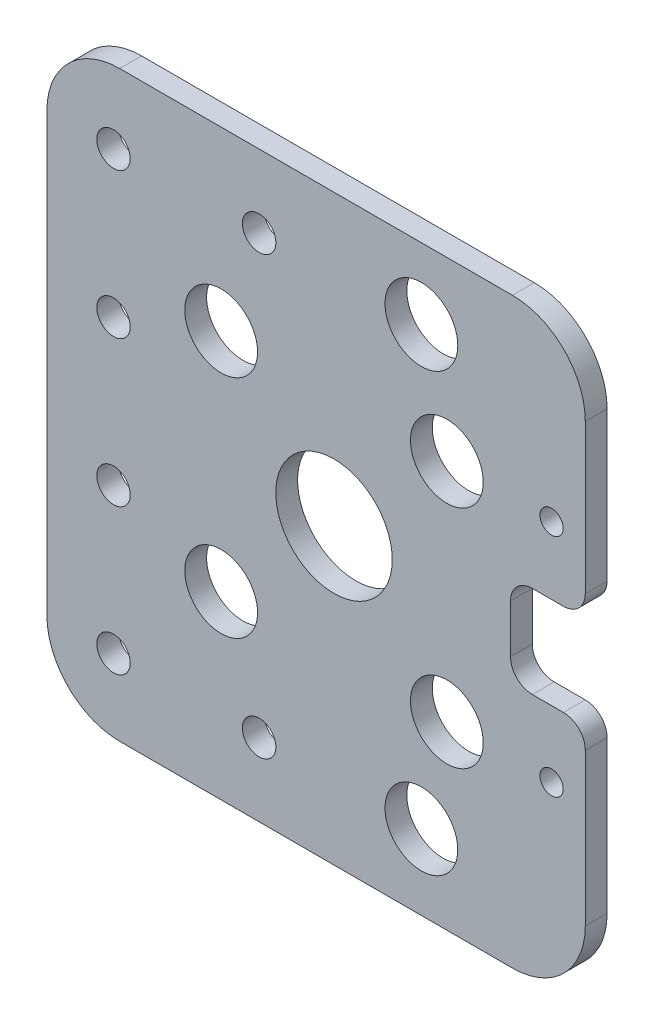
ISO-10303-21;
HEADER;
FILE_DESCRIPTION(('STEP AP214'),'2;1');
FILE_NAME('part.step','',(''),(''),'','','');
FILE_SCHEMA(('AUTOMOTIVE_DESIGN { 1 0 10303 214 1 1 1 1 }'));
ENDSEC;
DATA;
#1=APPLICATION_CONTEXT('core data for automotive mechanical design processes');
#2=APPLICATION_PROTOCOL_DEFINITION('international standard','automotive_design',2000,#1);
#3=PRODUCT_CONTEXT('',#1,'mechanical');
#4=PRODUCT('Part','Part','',(#3));
#5=PRODUCT_RELATED_PRODUCT_CATEGORY('part','',(#4));
#6=PRODUCT_DEFINITION_FORMATION('','',#4);
#7=PRODUCT_DEFINITION_CONTEXT('part definition',#1,'design');
#8=PRODUCT_DEFINITION('design','',#6,#7);
#9=PRODUCT_DEFINITION_SHAPE('','',#8);
#10=(LENGTH_UNIT() NAMED_UNIT(*) SI_UNIT(.MILLI.,.METRE.));
#11=(NAMED_UNIT(*) PLANE_ANGLE_UNIT() SI_UNIT($,.RADIAN.));
#12=(NAMED_UNIT(*) SI_UNIT($,.STERADIAN.) SOLID_ANGLE_UNIT());
#13=UNCERTAINTY_MEASURE_WITH_UNIT(LENGTH_MEASURE(1.E-05),#10,'distance_accuracy_value','');
#14=(GEOMETRIC_REPRESENTATION_CONTEXT(3) GLOBAL_UNCERTAINTY_ASSIGNED_CONTEXT((#13)) GLOBAL_UNIT_ASSIGNED_CONTEXT((#10,
#11,#12)) REPRESENTATION_CONTEXT('',''));
#15=CARTESIAN_POINT('',(0.,0.,0.));
#16=DIRECTION('',(0.,0.,1.));
#17=DIRECTION('',(1.,0.,0.));
#18=AXIS2_PLACEMENT_3D('',#15,#16,#17);
#19=CARTESIAN_POINT('',(170.473892307227,-141.896756478859,3.));
#20=DIRECTION('',(0.,0.,-1.));
#21=DIRECTION('',(-1.,0.,0.));
#22=AXIS2_PLACEMENT_3D('',#19,#20,#21);
#23=PLANE('',#22);
#24=DIRECTION('',(0.,1.,0.));
#25=VECTOR('',#24,1.);
#26=CARTESIAN_POINT('',(180.473892307227,-120.989469863567,3.));
#27=LINE('',#26,#25);
#28=CARTESIAN_POINT('',(180.473892307227,-141.896756478859,3.));
#29=VERTEX_POINT('',#28);
#30=CARTESIAN_POINT('',(180.473892307227,-120.989469863567,3.));
#31=VERTEX_POINT('',#30);
#32=EDGE_CURVE('E147',#29,#31,#27,.T.);
#33=ORIENTED_EDGE('',*,*,#32,.T.);
#34=CARTESIAN_POINT('',(177.473892307227,-120.989469863567,3.));
#35=DIRECTION('',(0.,0.,-1.));
#36=DIRECTION('',(-1.,0.,0.));
#37=AXIS2_PLACEMENT_3D('',#34,#35,#36);
#38=CIRCLE('',#37,3.);
#39=CARTESIAN_POINT('',(177.473892307227,-117.989469863567,3.));
#40=VERTEX_POINT('',#39);
#41=EDGE_CURVE('E195',#31,#40,#38,.F.);
#42=ORIENTED_EDGE('',*,*,#41,.T.);
#43=DIRECTION('',(-1.,0.,0.));
#44=VECTOR('',#43,1.);
#45=CARTESIAN_POINT('',(180.473892307227,-117.989469863567,3.));
#46=LINE('',#45,#44);
#47=CARTESIAN_POINT('',(173.198907284921,-117.989469863567,3.));
#48=VERTEX_POINT('',#47);
#49=EDGE_CURVE('E157',#40,#48,#46,.T.);
#50=ORIENTED_EDGE('',*,*,#49,.T.);
#51=CARTESIAN_POINT('',(173.198907284921,-114.989469863567,3.));
#52=DIRECTION('',(0.,0.,-1.));
#53=DIRECTION('',(-1.,0.,0.));
#54=AXIS2_PLACEMENT_3D('',#51,#52,#53);
#55=CIRCLE('',#54,3.);
#56=CARTESIAN_POINT('',(170.198907284921,-114.989469863567,3.));
#57=VERTEX_POINT('',#56);
#58=EDGE_CURVE('E206',#48,#57,#55,.T.);
#59=ORIENTED_EDGE('',*,*,#58,.T.);
#60=DIRECTION('',(0.,1.,0.));
#61=VECTOR('',#60,1.);
#62=CARTESIAN_POINT('',(170.198907284921,-105.365535019324,3.));
#63=LINE('',#62,#61);
#64=CARTESIAN_POINT('',(170.198907284921,-108.365535019324,3.));
#65=VERTEX_POINT('',#64);
#66=EDGE_CURVE('E229',#57,#65,#63,.T.);
#67=ORIENTED_EDGE('',*,*,#66,.T.);
#68=CARTESIAN_POINT('',(173.198907284921,-108.365535019324,3.));
#69=DIRECTION('',(0.,0.,-1.));
#70=DIRECTION('',(-1.,0.,0.));
#71=AXIS2_PLACEMENT_3D('',#68,#69,#70);
#72=CIRCLE('',#71,3.);
#73=CARTESIAN_POINT('',(173.198907284921,-105.365535019324,3.));
#74=VERTEX_POINT('',#73);
#75=EDGE_CURVE('E11',#65,#74,#72,.T.);
#76=ORIENTED_EDGE('',*,*,#75,.T.);
#77=DIRECTION('',(1.,0.,0.));
#78=VECTOR('',#77,1.);
#79=CARTESIAN_POINT('',(180.473892307227,-105.365535019324,3.));
#80=LINE('',#79,#78);
#81=CARTESIAN_POINT('',(177.473892307227,-105.365535019324,3.));
#82=VERTEX_POINT('',#81);
#83=EDGE_CURVE('E228',#74,#82,#80,.T.);
#84=ORIENTED_EDGE('',*,*,#83,.T.);
#85=CARTESIAN_POINT('',(177.473892307227,-102.365535019324,3.));
#86=DIRECTION('',(0.,0.,-1.));
#87=DIRECTION('',(-1.,0.,0.));
#88=AXIS2_PLACEMENT_3D('',#85,#86,#87);
#89=CIRCLE('',#88,3.);
#90=CARTESIAN_POINT('',(180.473892307227,-102.365535019324,3.));
#91=VERTEX_POINT('',#90);
#92=EDGE_CURVE('E48',#82,#91,#89,.F.);
#93=ORIENTED_EDGE('',*,*,#92,.T.);
#94=DIRECTION('',(0.,1.,0.));
#95=VECTOR('',#94,1.);
#96=CARTESIAN_POINT('',(180.473892307227,-102.365535019324,3.));
#97=LINE('',#96,#95);
#98=CARTESIAN_POINT('',(180.473892307227,-81.8661960079858,3.));
#99=VERTEX_POINT('',#98);
#100=EDGE_CURVE('E231',#91,#99,#97,.T.);
#101=ORIENTED_EDGE('',*,*,#100,.T.);
#102=CARTESIAN_POINT('',(170.473892307227,-81.8661960079857,3.));
#103=DIRECTION('',(0.,0.,1.));
#104=DIRECTION('',(1.,0.,0.));
#105=AXIS2_PLACEMENT_3D('',#102,#103,#104);
#106=CIRCLE('',#105,10.);
#107=CARTESIAN_POINT('',(170.473892307226,-71.8661960079857,3.));
#108=VERTEX_POINT('',#107);
#109=EDGE_CURVE('E233',#99,#108,#106,.T.);
#110=ORIENTED_EDGE('',*,*,#109,.T.);
#111=DIRECTION('',(-1.,0.,0.));
#112=VECTOR('',#111,1.);
#113=CARTESIAN_POINT('',(157.960700719284,-71.8661960079857,3.));
#114=LINE('',#113,#112);
#115=CARTESIAN_POINT('',(116.52582366594,-71.8661960079857,3.));
#116=VERTEX_POINT('',#115);
#117=EDGE_CURVE('E239',#108,#116,#114,.T.);
#118=ORIENTED_EDGE('',*,*,#117,.T.);
#119=CARTESIAN_POINT('',(116.52582366594,-81.8661960079857,3.));
#120=DIRECTION('',(0.,0.,1.));
#121=DIRECTION('',(1.,0.,0.));
#122=AXIS2_PLACEMENT_3D('',#119,#120,#121);
#123=CIRCLE('',#122,9.99999999999999);
#124=CARTESIAN_POINT('',(106.52582366594,-81.8661960079857,3.));
#125=VERTEX_POINT('',#124);
#126=EDGE_CURVE('E241',#116,#125,#123,.T.);
#127=ORIENTED_EDGE('',*,*,#126,.T.);
#128=DIRECTION('',(0.,-1.,0.));
#129=VECTOR('',#128,1.);
#130=CARTESIAN_POINT('',(106.52582366594,-81.8661960079857,3.));
#131=LINE('',#130,#129);
#132=CARTESIAN_POINT('',(106.52582366594,-141.896756478859,3.));
#133=VERTEX_POINT('',#132);
#134=EDGE_CURVE('E243',#125,#133,#131,.T.);
#135=ORIENTED_EDGE('',*,*,#134,.T.);
#136=CARTESIAN_POINT('',(116.52582366594,-141.896756478859,3.));
#137=DIRECTION('',(0.,0.,1.));
#138=DIRECTION('',(1.,0.,0.));
#139=AXIS2_PLACEMENT_3D('',#136,#137,#138);
#140=CIRCLE('',#139,9.99999999999999);
#141=CARTESIAN_POINT('',(116.52582366594,-151.896756478859,3.));
#142=VERTEX_POINT('',#141);
#143=EDGE_CURVE('E245',#133,#142,#140,.T.);
#144=ORIENTED_EDGE('',*,*,#143,.T.);
#145=DIRECTION('',(1.,0.,0.));
#146=VECTOR('',#145,1.);
#147=CARTESIAN_POINT('',(116.52582366594,-151.896756478859,3.));
#148=LINE('',#147,#146);
#149=CARTESIAN_POINT('',(170.473892307226,-151.896756478859,3.));
#150=VERTEX_POINT('',#149);
#151=EDGE_CURVE('E163',#142,#150,#148,.T.);
#152=ORIENTED_EDGE('',*,*,#151,.T.);
#153=CARTESIAN_POINT('',(170.473892307227,-141.896756478859,3.));
#154=DIRECTION('',(0.,0.,1.));
#155=DIRECTION('',(-1.,0.,0.));
#156=AXIS2_PLACEMENT_3D('',#153,#154,#155);
#157=CIRCLE('',#156,10.);
#158=EDGE_CURVE('E158',#150,#29,#157,.T.);
#159=ORIENTED_EDGE('',*,*,#158,.T.);
#160=EDGE_LOOP('',(#33,#42,#50,#59,#67,#76,#84,#93,#101,#110,#118,#127,#135,#144,#152,#159));
#161=FACE_BOUND('',#160,.T.);
#162=CARTESIAN_POINT('',(115.674612815836,-101.866196007986,3.));
#163=DIRECTION('',(0.,0.,1.));
#164=DIRECTION('',(1.,0.,0.));
#165=AXIS2_PLACEMENT_3D('',#162,#163,#164);
#166=CIRCLE('',#165,2.29999999999999);
#167=CARTESIAN_POINT('',(117.974612815836,-101.866196007986,3.));
#168=VERTEX_POINT('',#167);
#169=EDGE_CURVE('E251',#168,#168,#166,.T.);
#170=ORIENTED_EDGE('',*,*,#169,.F.);
#171=EDGE_LOOP('',(#170));
#172=FACE_BOUND('',#171,.T.);
#173=CARTESIAN_POINT('',(115.674612815836,-121.866196007986,3.));
#174=DIRECTION('',(0.,0.,1.));
#175=DIRECTION('',(1.,0.,0.));
#176=AXIS2_PLACEMENT_3D('',#173,#174,#175);
#177=CIRCLE('',#176,2.30000000000001);
#178=CARTESIAN_POINT('',(117.974612815836,-121.866196007986,3.));
#179=VERTEX_POINT('',#178);
#180=EDGE_CURVE('E376',#179,#179,#177,.T.);
#181=ORIENTED_EDGE('',*,*,#180,.F.);
#182=EDGE_LOOP('',(#181));
#183=FACE_BOUND('',#182,.T.);
#184=CARTESIAN_POINT('',(135.674612815836,-141.866196007986,3.));
#185=DIRECTION('',(0.,0.,1.));
#186=DIRECTION('',(1.,0.,0.));
#187=AXIS2_PLACEMENT_3D('',#184,#185,#186);
#188=CIRCLE('',#187,2.30000000000001);
#189=CARTESIAN_POINT('',(137.974612815836,-141.866196007986,3.));
#190=VERTEX_POINT('',#189);
#191=EDGE_CURVE('E382',#190,#190,#188,.T.);
#192=ORIENTED_EDGE('',*,*,#191,.F.);
#193=EDGE_LOOP('',(#192));
#194=FACE_BOUND('',#193,.T.);
#195=CARTESIAN_POINT('',(135.674612815836,-81.8661960079857,3.));
#196=DIRECTION('',(0.,0.,1.));
#197=DIRECTION('',(1.,0.,0.));
#198=AXIS2_PLACEMENT_3D('',#195,#196,#197);
#199=CIRCLE('',#198,2.30000000000001);
#200=CARTESIAN_POINT('',(137.974612815836,-81.8661960079857,3.));
#201=VERTEX_POINT('',#200);
#202=EDGE_CURVE('E388',#201,#201,#199,.T.);
#203=ORIENTED_EDGE('',*,*,#202,.F.);
#204=EDGE_LOOP('',(#203));
#205=FACE_BOUND('',#204,.T.);
#206=CARTESIAN_POINT('',(161.460700719284,-96.1142218306485,3.));
#207=DIRECTION('',(0.,0.,1.));
#208=DIRECTION('',(1.,0.,0.));
#209=AXIS2_PLACEMENT_3D('',#206,#207,#208);
#210=CIRCLE('',#209,4.99999999999999);
#211=CARTESIAN_POINT('',(166.460700719284,-96.1142218306485,3.));
#212=VERTEX_POINT('',#211);
#213=EDGE_CURVE('E394',#212,#212,#210,.T.);
#214=ORIENTED_EDGE('',*,*,#213,.F.);
#215=EDGE_LOOP('',(#214));
#216=FACE_BOUND('',#215,.T.);
#217=CARTESIAN_POINT('',(115.674612815836,-81.8661960079857,3.));
#218=DIRECTION('',(0.,0.,1.));
#219=DIRECTION('',(1.,0.,0.));
#220=AXIS2_PLACEMENT_3D('',#217,#218,#219);
#221=CIRCLE('',#220,2.29999999999999);
#222=CARTESIAN_POINT('',(117.974612815836,-81.8661960079857,3.));
#223=VERTEX_POINT('',#222);
#224=EDGE_CURVE('E400',#223,#223,#221,.T.);
#225=ORIENTED_EDGE('',*,*,#224,.F.);
#226=EDGE_LOOP('',(#225));
#227=FACE_BOUND('',#226,.T.);
#228=CARTESIAN_POINT('',(115.674612815836,-141.866196007986,3.));
#229=DIRECTION('',(0.,0.,1.));
#230=DIRECTION('',(1.,0.,0.));
#231=AXIS2_PLACEMENT_3D('',#228,#229,#230);
#232=CIRCLE('',#231,2.30000000000001);
#233=CARTESIAN_POINT('',(117.974612815836,-141.866196007986,3.));
#234=VERTEX_POINT('',#233);
#235=EDGE_CURVE('E406',#234,#234,#232,.T.);
#236=ORIENTED_EDGE('',*,*,#235,.F.);
#237=EDGE_LOOP('',(#236));
#238=FACE_BOUND('',#237,.T.);
#239=CARTESIAN_POINT('',(161.460700719284,-127.114221830649,3.));
#240=DIRECTION('',(0.,0.,1.));
#241=DIRECTION('',(1.,0.,0.));
#242=AXIS2_PLACEMENT_3D('',#239,#240,#241);
#243=CIRCLE('',#242,5.00000000000002);
#244=CARTESIAN_POINT('',(166.460700719284,-127.114221830649,3.));
#245=VERTEX_POINT('',#244);
#246=EDGE_CURVE('E412',#245,#245,#243,.T.);
#247=ORIENTED_EDGE('',*,*,#246,.F.);
#248=EDGE_LOOP('',(#247));
#249=FACE_BOUND('',#248,.T.);
#250=CARTESIAN_POINT('',(175.843347401342,-127.114221830649,3.));
#251=DIRECTION('',(0.,0.,1.));
#252=DIRECTION('',(1.,0.,0.));
#253=AXIS2_PLACEMENT_3D('',#250,#251,#252);
#254=CIRCLE('',#253,1.59999999999999);
#255=CARTESIAN_POINT('',(177.443347401342,-127.114221830649,3.));
#256=VERTEX_POINT('',#255);
#257=EDGE_CURVE('E418',#256,#256,#254,.T.);
#258=ORIENTED_EDGE('',*,*,#257,.F.);
#259=EDGE_LOOP('',(#258));
#260=FACE_BOUND('',#259,.T.);
#261=CARTESIAN_POINT('',(175.843347401342,-96.1142218306485,3.));
#262=DIRECTION('',(0.,0.,1.));
#263=DIRECTION('',(1.,0.,0.));
#264=AXIS2_PLACEMENT_3D('',#261,#262,#263);
#265=CIRCLE('',#264,1.59999999999999);
#266=CARTESIAN_POINT('',(177.443347401342,-96.1142218306485,3.));
#267=VERTEX_POINT('',#266);
#268=EDGE_CURVE('E424',#267,#267,#265,.T.);
#269=ORIENTED_EDGE('',*,*,#268,.F.);
#270=EDGE_LOOP('',(#269));
#271=FACE_BOUND('',#270,.T.);
#272=CARTESIAN_POINT('',(145.960700719284,-111.591712302338,3.));
#273=DIRECTION('',(0.,0.,1.));
#274=DIRECTION('',(1.,0.,0.));
#275=AXIS2_PLACEMENT_3D('',#272,#273,#274);
#276=CIRCLE('',#275,8.00000000000001);
#277=CARTESIAN_POINT('',(153.960700719284,-111.591712302338,3.));
#278=VERTEX_POINT('',#277);
#279=EDGE_CURVE('E430',#278,#278,#276,.T.);
#280=ORIENTED_EDGE('',*,*,#279,.F.);
#281=EDGE_LOOP('',(#280));
#282=FACE_BOUND('',#281,.T.);
#283=CARTESIAN_POINT('',(130.460700719283,-96.1142218306486,3.));
#284=DIRECTION('',(0.,0.,1.));
#285=DIRECTION('',(1.,0.,0.));
#286=AXIS2_PLACEMENT_3D('',#283,#284,#285);
#287=CIRCLE('',#286,5.00000000000002);
#288=CARTESIAN_POINT('',(135.460700719284,-96.1142218306486,3.));
#289=VERTEX_POINT('',#288);
#290=EDGE_CURVE('E436',#289,#289,#287,.T.);
#291=ORIENTED_EDGE('',*,*,#290,.F.);
#292=EDGE_LOOP('',(#291));
#293=FACE_BOUND('',#292,.T.);
#294=CARTESIAN_POINT('',(157.960700719284,-141.591712302338,3.));
#295=DIRECTION('',(0.,0.,1.));
#296=DIRECTION('',(1.,0.,0.));
#297=AXIS2_PLACEMENT_3D('',#294,#295,#296);
#298=CIRCLE('',#297,4.99999999999999);
#299=CARTESIAN_POINT('',(162.960700719284,-141.591712302338,3.));
#300=VERTEX_POINT('',#299);
#301=EDGE_CURVE('E442',#300,#300,#298,.T.);
#302=ORIENTED_EDGE('',*,*,#301,.F.);
#303=EDGE_LOOP('',(#302));
#304=FACE_BOUND('',#303,.T.);
#305=CARTESIAN_POINT('',(157.960700719284,-81.5917123023381,3.));
#306=DIRECTION('',(0.,0.,1.));
#307=DIRECTION('',(1.,0.,0.));
#308=AXIS2_PLACEMENT_3D('',#305,#306,#307);
#309=CIRCLE('',#308,5.00000000000002);
#310=CARTESIAN_POINT('',(162.960700719284,-81.5917123023381,3.));
#311=VERTEX_POINT('',#310);
#312=EDGE_CURVE('E448',#311,#311,#309,.T.);
#313=ORIENTED_EDGE('',*,*,#312,.F.);
#314=EDGE_LOOP('',(#313));
#315=FACE_BOUND('',#314,.T.);
#316=CARTESIAN_POINT('',(130.460700719283,-127.114221830649,3.));
#317=DIRECTION('',(0.,0.,1.));
#318=DIRECTION('',(1.,0.,0.));
#319=AXIS2_PLACEMENT_3D('',#316,#317,#318);
#320=CIRCLE('',#319,4.99999999999999);
#321=CARTESIAN_POINT('',(135.460700719284,-127.114221830649,3.));
#322=VERTEX_POINT('',#321);
#323=EDGE_CURVE('E454',#322,#322,#320,.T.);
#324=ORIENTED_EDGE('',*,*,#323,.F.);
#325=EDGE_LOOP('',(#324));
#326=FACE_BOUND('',#325,.T.);
#327=ADVANCED_FACE('F33',(#161,#172,#183,#194,#205,#216,#227,#238,#249,#260,#271,#282,#293,#304,
#315,#326),#23,.F.);
#328=CARTESIAN_POINT('',(170.473892307227,-141.896756478859,0.));
#329=DIRECTION('',(0.,0.,-1.));
#330=DIRECTION('',(-1.,0.,0.));
#331=AXIS2_PLACEMENT_3D('',#328,#329,#330);
#332=PLANE('',#331);
#333=CARTESIAN_POINT('',(157.960700719284,-81.5917123023381,0.));
#334=DIRECTION('',(0.,0.,1.));
#335=DIRECTION('',(1.,0.,0.));
#336=AXIS2_PLACEMENT_3D('',#333,#334,#335);
#337=CIRCLE('',#336,5.00000000000002);
#338=CARTESIAN_POINT('',(162.960700719284,-81.5917123023381,0.));
#339=VERTEX_POINT('',#338);
#340=EDGE_CURVE('E451',#339,#339,#337,.T.);
#341=ORIENTED_EDGE('',*,*,#340,.T.);
#342=EDGE_LOOP('',(#341));
#343=FACE_BOUND('',#342,.T.);
#344=CARTESIAN_POINT('',(130.460700719283,-96.1142218306486,0.));
#345=DIRECTION('',(0.,0.,1.));
#346=DIRECTION('',(1.,0.,0.));
#347=AXIS2_PLACEMENT_3D('',#344,#345,#346);
#348=CIRCLE('',#347,5.00000000000002);
#349=CARTESIAN_POINT('',(135.460700719284,-96.1142218306486,0.));
#350=VERTEX_POINT('',#349);
#351=EDGE_CURVE('E439',#350,#350,#348,.T.);
#352=ORIENTED_EDGE('',*,*,#351,.T.);
#353=EDGE_LOOP('',(#352));
#354=FACE_BOUND('',#353,.T.);
#355=CARTESIAN_POINT('',(175.843347401342,-96.1142218306485,0.));
#356=DIRECTION('',(0.,0.,1.));
#357=DIRECTION('',(1.,0.,0.));
#358=AXIS2_PLACEMENT_3D('',#355,#356,#357);
#359=CIRCLE('',#358,1.59999999999999);
#360=CARTESIAN_POINT('',(177.443347401342,-96.1142218306485,0.));
#361=VERTEX_POINT('',#360);
#362=EDGE_CURVE('E427',#361,#361,#359,.T.);
#363=ORIENTED_EDGE('',*,*,#362,.T.);
#364=EDGE_LOOP('',(#363));
#365=FACE_BOUND('',#364,.T.);
#366=CARTESIAN_POINT('',(161.460700719284,-127.114221830649,0.));
#367=DIRECTION('',(0.,0.,1.));
#368=DIRECTION('',(1.,0.,0.));
#369=AXIS2_PLACEMENT_3D('',#366,#367,#368);
#370=CIRCLE('',#369,5.00000000000002);
#371=CARTESIAN_POINT('',(166.460700719284,-127.114221830649,0.));
#372=VERTEX_POINT('',#371);
#373=EDGE_CURVE('E415',#372,#372,#370,.T.);
#374=ORIENTED_EDGE('',*,*,#373,.T.);
#375=EDGE_LOOP('',(#374));
#376=FACE_BOUND('',#375,.T.);
#377=CARTESIAN_POINT('',(115.674612815836,-81.8661960079857,0.));
#378=DIRECTION('',(0.,0.,1.));
#379=DIRECTION('',(1.,0.,0.));
#380=AXIS2_PLACEMENT_3D('',#377,#378,#379);
#381=CIRCLE('',#380,2.29999999999999);
#382=CARTESIAN_POINT('',(117.974612815836,-81.8661960079857,0.));
#383=VERTEX_POINT('',#382);
#384=EDGE_CURVE('E403',#383,#383,#381,.T.);
#385=ORIENTED_EDGE('',*,*,#384,.T.);
#386=EDGE_LOOP('',(#385));
#387=FACE_BOUND('',#386,.T.);
#388=CARTESIAN_POINT('',(135.674612815836,-81.8661960079857,0.));
#389=DIRECTION('',(0.,0.,1.));
#390=DIRECTION('',(1.,0.,0.));
#391=AXIS2_PLACEMENT_3D('',#388,#389,#390);
#392=CIRCLE('',#391,2.30000000000001);
#393=CARTESIAN_POINT('',(137.974612815836,-81.8661960079857,0.));
#394=VERTEX_POINT('',#393);
#395=EDGE_CURVE('E391',#394,#394,#392,.T.);
#396=ORIENTED_EDGE('',*,*,#395,.T.);
#397=EDGE_LOOP('',(#396));
#398=FACE_BOUND('',#397,.T.);
#399=CARTESIAN_POINT('',(115.674612815836,-121.866196007986,0.));
#400=DIRECTION('',(0.,0.,1.));
#401=DIRECTION('',(1.,0.,0.));
#402=AXIS2_PLACEMENT_3D('',#399,#400,#401);
#403=CIRCLE('',#402,2.30000000000001);
#404=CARTESIAN_POINT('',(117.974612815836,-121.866196007986,0.));
#405=VERTEX_POINT('',#404);
#406=EDGE_CURVE('E379',#405,#405,#403,.T.);
#407=ORIENTED_EDGE('',*,*,#406,.T.);
#408=EDGE_LOOP('',(#407));
#409=FACE_BOUND('',#408,.T.);
#410=DIRECTION('',(-1.,0.,0.));
#411=VECTOR('',#410,1.);
#412=CARTESIAN_POINT('',(180.473892307227,-117.989469863567,0.));
#413=LINE('',#412,#411);
#414=CARTESIAN_POINT('',(177.473892307227,-117.989469863567,0.));
#415=VERTEX_POINT('',#414);
#416=CARTESIAN_POINT('',(173.198907284921,-117.989469863567,0.));
#417=VERTEX_POINT('',#416);
#418=EDGE_CURVE('E224',#415,#417,#413,.T.);
#419=ORIENTED_EDGE('',*,*,#418,.F.);
#420=CARTESIAN_POINT('',(177.473892307227,-120.989469863567,0.));
#421=DIRECTION('',(0.,0.,-1.));
#422=DIRECTION('',(-1.,0.,0.));
#423=AXIS2_PLACEMENT_3D('',#420,#421,#422);
#424=CIRCLE('',#423,3.);
#425=CARTESIAN_POINT('',(180.473892307227,-120.989469863567,0.));
#426=VERTEX_POINT('',#425);
#427=EDGE_CURVE('E191',#415,#426,#424,.T.);
#428=ORIENTED_EDGE('',*,*,#427,.T.);
#429=DIRECTION('',(0.,1.,0.));
#430=VECTOR('',#429,1.);
#431=CARTESIAN_POINT('',(180.473892307227,-120.989469863567,0.));
#432=LINE('',#431,#430);
#433=CARTESIAN_POINT('',(180.473892307227,-141.896756478859,0.));
#434=VERTEX_POINT('',#433);
#435=EDGE_CURVE('E250',#434,#426,#432,.T.);
#436=ORIENTED_EDGE('',*,*,#435,.F.);
#437=CARTESIAN_POINT('',(170.473892307227,-141.896756478859,0.));
#438=DIRECTION('',(0.,0.,1.));
#439=DIRECTION('',(-1.,0.,0.));
#440=AXIS2_PLACEMENT_3D('',#437,#438,#439);
#441=CIRCLE('',#440,10.);
#442=CARTESIAN_POINT('',(170.473892307226,-151.896756478859,0.));
#443=VERTEX_POINT('',#442);
#444=EDGE_CURVE('E171',#443,#434,#441,.T.);
#445=ORIENTED_EDGE('',*,*,#444,.F.);
#446=DIRECTION('',(1.,0.,0.));
#447=VECTOR('',#446,1.);
#448=CARTESIAN_POINT('',(170.473892307226,-151.896756478859,0.));
#449=LINE('',#448,#447);
#450=CARTESIAN_POINT('',(116.52582366594,-151.896756478859,0.));
#451=VERTEX_POINT('',#450);
#452=EDGE_CURVE('E167',#451,#443,#449,.T.);
#453=ORIENTED_EDGE('',*,*,#452,.F.);
#454=CARTESIAN_POINT('',(116.52582366594,-141.896756478859,0.));
#455=DIRECTION('',(0.,0.,1.));
#456=DIRECTION('',(1.,0.,0.));
#457=AXIS2_PLACEMENT_3D('',#454,#455,#456);
#458=CIRCLE('',#457,9.99999999999999);
#459=CARTESIAN_POINT('',(106.52582366594,-141.896756478859,0.));
#460=VERTEX_POINT('',#459);
#461=EDGE_CURVE('E267',#460,#451,#458,.T.);
#462=ORIENTED_EDGE('',*,*,#461,.F.);
#463=DIRECTION('',(0.,-1.,0.));
#464=VECTOR('',#463,1.);
#465=CARTESIAN_POINT('',(106.52582366594,-81.8661960079857,0.));
#466=LINE('',#465,#464);
#467=CARTESIAN_POINT('',(106.52582366594,-81.8661960079857,0.));
#468=VERTEX_POINT('',#467);
#469=EDGE_CURVE('E265',#468,#460,#466,.T.);
#470=ORIENTED_EDGE('',*,*,#469,.F.);
#471=CARTESIAN_POINT('',(116.52582366594,-81.8661960079857,0.));
#472=DIRECTION('',(0.,0.,1.));
#473=DIRECTION('',(1.,0.,0.));
#474=AXIS2_PLACEMENT_3D('',#471,#472,#473);
#475=CIRCLE('',#474,9.99999999999999);
#476=CARTESIAN_POINT('',(116.52582366594,-71.8661960079857,0.));
#477=VERTEX_POINT('',#476);
#478=EDGE_CURVE('E263',#477,#468,#475,.T.);
#479=ORIENTED_EDGE('',*,*,#478,.F.);
#480=DIRECTION('',(-1.,0.,0.));
#481=VECTOR('',#480,1.);
#482=CARTESIAN_POINT('',(116.52582366594,-71.8661960079857,0.));
#483=LINE('',#482,#481);
#484=CARTESIAN_POINT('',(170.473892307226,-71.8661960079857,0.));
#485=VERTEX_POINT('',#484);
#486=EDGE_CURVE('E261',#485,#477,#483,.T.);
#487=ORIENTED_EDGE('',*,*,#486,.F.);
#488=CARTESIAN_POINT('',(170.473892307227,-81.8661960079857,0.));
#489=DIRECTION('',(0.,0.,1.));
#490=DIRECTION('',(1.,0.,0.));
#491=AXIS2_PLACEMENT_3D('',#488,#489,#490);
#492=CIRCLE('',#491,10.);
#493=CARTESIAN_POINT('',(180.473892307227,-81.8661960079858,0.));
#494=VERTEX_POINT('',#493);
#495=EDGE_CURVE('E258',#494,#485,#492,.T.);
#496=ORIENTED_EDGE('',*,*,#495,.F.);
#497=DIRECTION('',(0.,1.,0.));
#498=VECTOR('',#497,1.);
#499=CARTESIAN_POINT('',(180.473892307227,-81.8661960079858,0.));
#500=LINE('',#499,#498);
#501=CARTESIAN_POINT('',(180.473892307227,-102.365535019324,0.));
#502=VERTEX_POINT('',#501);
#503=EDGE_CURVE('E256',#502,#494,#500,.T.);
#504=ORIENTED_EDGE('',*,*,#503,.F.);
#505=CARTESIAN_POINT('',(177.473892307227,-102.365535019324,0.));
#506=DIRECTION('',(0.,0.,-1.));
#507=DIRECTION('',(-1.,0.,0.));
#508=AXIS2_PLACEMENT_3D('',#505,#506,#507);
#509=CIRCLE('',#508,3.);
#510=CARTESIAN_POINT('',(177.473892307227,-105.365535019324,0.));
#511=VERTEX_POINT('',#510);
#512=EDGE_CURVE('E189',#502,#511,#509,.T.);
#513=ORIENTED_EDGE('',*,*,#512,.T.);
#514=DIRECTION('',(1.,0.,0.));
#515=VECTOR('',#514,1.);
#516=CARTESIAN_POINT('',(180.473892307227,-105.365535019324,0.));
#517=LINE('',#516,#515);
#518=CARTESIAN_POINT('',(173.198907284921,-105.365535019324,0.));
#519=VERTEX_POINT('',#518);
#520=EDGE_CURVE('E215',#519,#511,#517,.T.);
#521=ORIENTED_EDGE('',*,*,#520,.F.);
#522=CARTESIAN_POINT('',(173.198907284921,-108.365535019324,0.));
#523=DIRECTION('',(0.,0.,-1.));
#524=DIRECTION('',(-1.,0.,0.));
#525=AXIS2_PLACEMENT_3D('',#522,#523,#524);
#526=CIRCLE('',#525,3.);
#527=CARTESIAN_POINT('',(170.198907284921,-108.365535019324,0.));
#528=VERTEX_POINT('',#527);
#529=EDGE_CURVE('E41',#519,#528,#526,.F.);
#530=ORIENTED_EDGE('',*,*,#529,.T.);
#531=DIRECTION('',(0.,1.,0.));
#532=VECTOR('',#531,1.);
#533=CARTESIAN_POINT('',(170.198907284921,-105.365535019324,0.));
#534=LINE('',#533,#532);
#535=CARTESIAN_POINT('',(170.198907284921,-114.989469863567,0.));
#536=VERTEX_POINT('',#535);
#537=EDGE_CURVE('E214',#536,#528,#534,.T.);
#538=ORIENTED_EDGE('',*,*,#537,.F.);
#539=CARTESIAN_POINT('',(173.198907284921,-114.989469863567,0.));
#540=DIRECTION('',(0.,0.,-1.));
#541=DIRECTION('',(-1.,0.,0.));
#542=AXIS2_PLACEMENT_3D('',#539,#540,#541);
#543=CIRCLE('',#542,3.);
#544=EDGE_CURVE('E204',#536,#417,#543,.F.);
#545=ORIENTED_EDGE('',*,*,#544,.T.);
#546=EDGE_LOOP('',(#419,#428,#436,#445,#453,#462,#470,#479,#487,#496,#504,#513,#521,#530,#538,#545));
#547=FACE_BOUND('',#546,.T.);
#548=CARTESIAN_POINT('',(115.674612815836,-101.866196007986,0.));
#549=DIRECTION('',(0.,0.,1.));
#550=DIRECTION('',(1.,0.,0.));
#551=AXIS2_PLACEMENT_3D('',#548,#549,#550);
#552=CIRCLE('',#551,2.29999999999999);
#553=CARTESIAN_POINT('',(117.974612815836,-101.866196007986,0.));
#554=VERTEX_POINT('',#553);
#555=EDGE_CURVE('E373',#554,#554,#552,.T.);
#556=ORIENTED_EDGE('',*,*,#555,.T.);
#557=EDGE_LOOP('',(#556));
#558=FACE_BOUND('',#557,.T.);
#559=CARTESIAN_POINT('',(135.674612815836,-141.866196007986,0.));
#560=DIRECTION('',(0.,0.,1.));
#561=DIRECTION('',(1.,0.,0.));
#562=AXIS2_PLACEMENT_3D('',#559,#560,#561);
#563=CIRCLE('',#562,2.30000000000001);
#564=CARTESIAN_POINT('',(137.974612815836,-141.866196007986,0.));
#565=VERTEX_POINT('',#564);
#566=EDGE_CURVE('E385',#565,#565,#563,.T.);
#567=ORIENTED_EDGE('',*,*,#566,.T.);
#568=EDGE_LOOP('',(#567));
#569=FACE_BOUND('',#568,.T.);
#570=CARTESIAN_POINT('',(161.460700719284,-96.1142218306485,0.));
#571=DIRECTION('',(0.,0.,1.));
#572=DIRECTION('',(1.,0.,0.));
#573=AXIS2_PLACEMENT_3D('',#570,#571,#572);
#574=CIRCLE('',#573,4.99999999999999);
#575=CARTESIAN_POINT('',(166.460700719284,-96.1142218306485,0.));
#576=VERTEX_POINT('',#575);
#577=EDGE_CURVE('E397',#576,#576,#574,.T.);
#578=ORIENTED_EDGE('',*,*,#577,.T.);
#579=EDGE_LOOP('',(#578));
#580=FACE_BOUND('',#579,.T.);
#581=CARTESIAN_POINT('',(115.674612815836,-141.866196007986,0.));
#582=DIRECTION('',(0.,0.,1.));
#583=DIRECTION('',(1.,0.,0.));
#584=AXIS2_PLACEMENT_3D('',#581,#582,#583);
#585=CIRCLE('',#584,2.30000000000001);
#586=CARTESIAN_POINT('',(117.974612815836,-141.866196007986,0.));
#587=VERTEX_POINT('',#586);
#588=EDGE_CURVE('E409',#587,#587,#585,.T.);
#589=ORIENTED_EDGE('',*,*,#588,.T.);
#590=EDGE_LOOP('',(#589));
#591=FACE_BOUND('',#590,.T.);
#592=CARTESIAN_POINT('',(175.843347401342,-127.114221830649,0.));
#593=DIRECTION('',(0.,0.,1.));
#594=DIRECTION('',(1.,0.,0.));
#595=AXIS2_PLACEMENT_3D('',#592,#593,#594);
#596=CIRCLE('',#595,1.59999999999999);
#597=CARTESIAN_POINT('',(177.443347401342,-127.114221830649,0.));
#598=VERTEX_POINT('',#597);
#599=EDGE_CURVE('E421',#598,#598,#596,.T.);
#600=ORIENTED_EDGE('',*,*,#599,.T.);
#601=EDGE_LOOP('',(#600));
#602=FACE_BOUND('',#601,.T.);
#603=CARTESIAN_POINT('',(145.960700719284,-111.591712302338,0.));
#604=DIRECTION('',(0.,0.,1.));
#605=DIRECTION('',(1.,0.,0.));
#606=AXIS2_PLACEMENT_3D('',#603,#604,#605);
#607=CIRCLE('',#606,8.00000000000001);
#608=CARTESIAN_POINT('',(153.960700719284,-111.591712302338,0.));
#609=VERTEX_POINT('',#608);
#610=EDGE_CURVE('E433',#609,#609,#607,.T.);
#611=ORIENTED_EDGE('',*,*,#610,.T.);
#612=EDGE_LOOP('',(#611));
#613=FACE_BOUND('',#612,.T.);
#614=CARTESIAN_POINT('',(157.960700719284,-141.591712302338,0.));
#615=DIRECTION('',(0.,0.,1.));
#616=DIRECTION('',(1.,0.,0.));
#617=AXIS2_PLACEMENT_3D('',#614,#615,#616);
#618=CIRCLE('',#617,4.99999999999999);
#619=CARTESIAN_POINT('',(162.960700719284,-141.591712302338,0.));
#620=VERTEX_POINT('',#619);
#621=EDGE_CURVE('E445',#620,#620,#618,.T.);
#622=ORIENTED_EDGE('',*,*,#621,.T.);
#623=EDGE_LOOP('',(#622));
#624=FACE_BOUND('',#623,.T.);
#625=CARTESIAN_POINT('',(130.460700719283,-127.114221830649,0.));
#626=DIRECTION('',(0.,0.,1.));
#627=DIRECTION('',(1.,0.,0.));
#628=AXIS2_PLACEMENT_3D('',#625,#626,#627);
#629=CIRCLE('',#628,4.99999999999999);
#630=CARTESIAN_POINT('',(135.460700719284,-127.114221830649,0.));
#631=VERTEX_POINT('',#630);
#632=EDGE_CURVE('E457',#631,#631,#629,.T.);
#633=ORIENTED_EDGE('',*,*,#632,.T.);
#634=EDGE_LOOP('',(#633));
#635=FACE_BOUND('',#634,.T.);
#636=ADVANCED_FACE('F212',(#343,#354,#365,#376,#387,#398,#409,#547,#558,#569,#580,#591,#602,
#613,#624,#635),#332,.T.);
#637=CARTESIAN_POINT('',(170.473892307227,-141.896756478859,3.));
#638=DIRECTION('',(0.,0.,-1.));
#639=DIRECTION('',(-1.,0.,0.));
#640=AXIS2_PLACEMENT_3D('',#637,#638,#639);
#641=CYLINDRICAL_SURFACE('',#640,10.);
#642=ORIENTED_EDGE('',*,*,#444,.T.);
#643=DIRECTION('',(0.,0.,-1.));
#644=VECTOR('',#643,1.);
#645=CARTESIAN_POINT('',(180.473892307227,-141.896756478859,3.));
#646=LINE('',#645,#644);
#647=EDGE_CURVE('E152',#29,#434,#646,.T.);
#648=ORIENTED_EDGE('',*,*,#647,.F.);
#649=ORIENTED_EDGE('',*,*,#158,.F.);
#650=DIRECTION('',(0.,0.,-1.));
#651=VECTOR('',#650,1.);
#652=CARTESIAN_POINT('',(170.473892307226,-151.896756478859,3.));
#653=LINE('',#652,#651);
#654=EDGE_CURVE('E248',#150,#443,#653,.T.);
#655=ORIENTED_EDGE('',*,*,#654,.T.);
#656=EDGE_LOOP('',(#642,#648,#649,#655));
#657=FACE_BOUND('',#656,.T.);
#658=ADVANCED_FACE('F169',(#657),#641,.T.);
#659=CARTESIAN_POINT('',(180.473892307227,-120.989469863567,3.));
#660=DIRECTION('',(-1.,0.,0.));
#661=DIRECTION('',(0.,0.,1.));
#662=AXIS2_PLACEMENT_3D('',#659,#660,#661);
#663=PLANE('',#662);
#664=ORIENTED_EDGE('',*,*,#435,.T.);
#665=DIRECTION('',(0.,0.,-1.));
#666=VECTOR('',#665,1.);
#667=CARTESIAN_POINT('',(180.473892307227,-120.989469863567,3.));
#668=LINE('',#667,#666);
#669=EDGE_CURVE('E155',#426,#31,#668,.F.);
#670=ORIENTED_EDGE('',*,*,#669,.T.);
#671=ORIENTED_EDGE('',*,*,#32,.F.);
#672=ORIENTED_EDGE('',*,*,#647,.T.);
#673=EDGE_LOOP('',(#664,#670,#671,#672));
#674=FACE_BOUND('',#673,.T.);
#675=ADVANCED_FACE('F150',(#674),#663,.F.);
#676=CARTESIAN_POINT('',(180.473892307227,-117.989469863567,3.));
#677=DIRECTION('',(0.,-1.,0.));
#678=DIRECTION('',(0.,0.,-1.));
#679=AXIS2_PLACEMENT_3D('',#676,#677,#678);
#680=PLANE('',#679);
#681=ORIENTED_EDGE('',*,*,#418,.T.);
#682=DIRECTION('',(0.,0.,-1.));
#683=VECTOR('',#682,1.);
#684=CARTESIAN_POINT('',(173.198907284921,-117.989469863567,3.));
#685=LINE('',#684,#683);
#686=EDGE_CURVE('E187',#417,#48,#685,.F.);
#687=ORIENTED_EDGE('',*,*,#686,.T.);
#688=ORIENTED_EDGE('',*,*,#49,.F.);
#689=DIRECTION('',(0.,0.,-1.));
#690=VECTOR('',#689,1.);
#691=CARTESIAN_POINT('',(177.473892307227,-117.989469863567,3.));
#692=LINE('',#691,#690);
#693=EDGE_CURVE('E184',#40,#415,#692,.T.);
#694=ORIENTED_EDGE('',*,*,#693,.T.);
#695=EDGE_LOOP('',(#681,#687,#688,#694));
#696=FACE_BOUND('',#695,.T.);
#697=ADVANCED_FACE('F350',(#696),#680,.F.);
#698=CARTESIAN_POINT('',(170.198907284921,-105.365535019324,3.));
#699=DIRECTION('',(-1.,0.,0.));
#700=DIRECTION('',(0.,0.,1.));
#701=AXIS2_PLACEMENT_3D('',#698,#699,#700);
#702=PLANE('',#701);
#703=ORIENTED_EDGE('',*,*,#66,.F.);
#704=DIRECTION('',(0.,0.,-1.));
#705=VECTOR('',#704,1.);
#706=CARTESIAN_POINT('',(170.198907284921,-114.989469863567,0.));
#707=LINE('',#706,#705);
#708=EDGE_CURVE('E175',#57,#536,#707,.T.);
#709=ORIENTED_EDGE('',*,*,#708,.T.);
#710=ORIENTED_EDGE('',*,*,#537,.T.);
#711=DIRECTION('',(0.,0.,-1.));
#712=VECTOR('',#711,1.);
#713=CARTESIAN_POINT('',(170.198907284921,-108.365535019324,3.));
#714=LINE('',#713,#712);
#715=EDGE_CURVE('E172',#528,#65,#714,.F.);
#716=ORIENTED_EDGE('',*,*,#715,.T.);
#717=EDGE_LOOP('',(#703,#709,#710,#716));
#718=FACE_BOUND('',#717,.T.);
#719=ADVANCED_FACE('F221',(#718),#702,.F.);
#720=CARTESIAN_POINT('',(180.473892307227,-105.365535019324,3.));
#721=DIRECTION('',(0.,1.,0.));
#722=DIRECTION('',(0.,0.,1.));
#723=AXIS2_PLACEMENT_3D('',#720,#721,#722);
#724=PLANE('',#723);
#725=ORIENTED_EDGE('',*,*,#83,.F.);
#726=DIRECTION('',(0.,0.,-1.));
#727=VECTOR('',#726,1.);
#728=CARTESIAN_POINT('',(173.198907284921,-105.365535019324,0.));
#729=LINE('',#728,#727);
#730=EDGE_CURVE('E198',#74,#519,#729,.T.);
#731=ORIENTED_EDGE('',*,*,#730,.T.);
#732=ORIENTED_EDGE('',*,*,#520,.T.);
#733=DIRECTION('',(0.,0.,-1.));
#734=VECTOR('',#733,1.);
#735=CARTESIAN_POINT('',(177.473892307227,-105.365535019324,3.));
#736=LINE('',#735,#734);
#737=EDGE_CURVE('E56',#511,#82,#736,.F.);
#738=ORIENTED_EDGE('',*,*,#737,.T.);
#739=EDGE_LOOP('',(#725,#731,#732,#738));
#740=FACE_BOUND('',#739,.T.);
#741=ADVANCED_FACE('F230',(#740),#724,.F.);
#742=CARTESIAN_POINT('',(180.473892307227,-81.8661960079858,3.));
#743=DIRECTION('',(-1.,0.,0.));
#744=DIRECTION('',(0.,0.,1.));
#745=AXIS2_PLACEMENT_3D('',#742,#743,#744);
#746=PLANE('',#745);
#747=ORIENTED_EDGE('',*,*,#100,.F.);
#748=DIRECTION('',(0.,0.,-1.));
#749=VECTOR('',#748,1.);
#750=CARTESIAN_POINT('',(180.473892307227,-102.365535019324,3.));
#751=LINE('',#750,#749);
#752=EDGE_CURVE('E201',#91,#502,#751,.T.);
#753=ORIENTED_EDGE('',*,*,#752,.T.);
#754=ORIENTED_EDGE('',*,*,#503,.T.);
#755=DIRECTION('',(0.,0.,-1.));
#756=VECTOR('',#755,1.);
#757=CARTESIAN_POINT('',(180.473892307227,-81.8661960079858,3.));
#758=LINE('',#757,#756);
#759=EDGE_CURVE('E173',#99,#494,#758,.T.);
#760=ORIENTED_EDGE('',*,*,#759,.F.);
#761=EDGE_LOOP('',(#747,#753,#754,#760));
#762=FACE_BOUND('',#761,.T.);
#763=ADVANCED_FACE('F310',(#762),#746,.F.);
#764=CARTESIAN_POINT('',(170.473892307227,-81.8661960079857,3.));
#765=DIRECTION('',(0.,0.,-1.));
#766=DIRECTION('',(-1.,0.,0.));
#767=AXIS2_PLACEMENT_3D('',#764,#765,#766);
#768=CYLINDRICAL_SURFACE('',#767,10.);
#769=ORIENTED_EDGE('',*,*,#495,.T.);
#770=DIRECTION('',(0.,0.,-1.));
#771=VECTOR('',#770,1.);
#772=CARTESIAN_POINT('',(170.473892307226,-71.8661960079857,3.));
#773=LINE('',#772,#771);
#774=EDGE_CURVE('E178',#108,#485,#773,.T.);
#775=ORIENTED_EDGE('',*,*,#774,.F.);
#776=ORIENTED_EDGE('',*,*,#109,.F.);
#777=ORIENTED_EDGE('',*,*,#759,.T.);
#778=EDGE_LOOP('',(#769,#775,#776,#777));
#779=FACE_BOUND('',#778,.T.);
#780=ADVANCED_FACE('F291',(#779),#768,.T.);
#781=CARTESIAN_POINT('',(116.52582366594,-71.8661960079857,3.));
#782=DIRECTION('',(0.,-1.,0.));
#783=DIRECTION('',(0.,0.,-1.));
#784=AXIS2_PLACEMENT_3D('',#781,#782,#783);
#785=PLANE('',#784);
#786=ORIENTED_EDGE('',*,*,#486,.T.);
#787=DIRECTION('',(0.,0.,-1.));
#788=VECTOR('',#787,1.);
#789=CARTESIAN_POINT('',(116.52582366594,-71.8661960079857,3.));
#790=LINE('',#789,#788);
#791=EDGE_CURVE('E281',#116,#477,#790,.T.);
#792=ORIENTED_EDGE('',*,*,#791,.F.);
#793=ORIENTED_EDGE('',*,*,#117,.F.);
#794=ORIENTED_EDGE('',*,*,#774,.T.);
#795=EDGE_LOOP('',(#786,#792,#793,#794));
#796=FACE_BOUND('',#795,.T.);
#797=ADVANCED_FACE('F287',(#796),#785,.F.);
#798=CARTESIAN_POINT('',(116.52582366594,-81.8661960079857,3.));
#799=DIRECTION('',(0.,0.,-1.));
#800=DIRECTION('',(-1.,0.,0.));
#801=AXIS2_PLACEMENT_3D('',#798,#799,#800);
#802=CYLINDRICAL_SURFACE('',#801,9.99999999999999);
#803=ORIENTED_EDGE('',*,*,#478,.T.);
#804=DIRECTION('',(0.,0.,-1.));
#805=VECTOR('',#804,1.);
#806=CARTESIAN_POINT('',(106.52582366594,-81.8661960079857,3.));
#807=LINE('',#806,#805);
#808=EDGE_CURVE('E278',#125,#468,#807,.T.);
#809=ORIENTED_EDGE('',*,*,#808,.F.);
#810=ORIENTED_EDGE('',*,*,#126,.F.);
#811=ORIENTED_EDGE('',*,*,#791,.T.);
#812=EDGE_LOOP('',(#803,#809,#810,#811));
#813=FACE_BOUND('',#812,.T.);
#814=ADVANCED_FACE('F300',(#813),#802,.T.);
#815=CARTESIAN_POINT('',(106.52582366594,-81.8661960079857,3.));
#816=DIRECTION('',(1.,0.,0.));
#817=DIRECTION('',(0.,1.,0.));
#818=AXIS2_PLACEMENT_3D('',#815,#816,#817);
#819=PLANE('',#818);
#820=ORIENTED_EDGE('',*,*,#469,.T.);
#821=DIRECTION('',(0.,0.,-1.));
#822=VECTOR('',#821,1.);
#823=CARTESIAN_POINT('',(106.52582366594,-141.896756478859,3.));
#824=LINE('',#823,#822);
#825=EDGE_CURVE('E275',#133,#460,#824,.T.);
#826=ORIENTED_EDGE('',*,*,#825,.F.);
#827=ORIENTED_EDGE('',*,*,#134,.F.);
#828=ORIENTED_EDGE('',*,*,#808,.T.);
#829=EDGE_LOOP('',(#820,#826,#827,#828));
#830=FACE_BOUND('',#829,.T.);
#831=ADVANCED_FACE('F304',(#830),#819,.F.);
#832=CARTESIAN_POINT('',(116.52582366594,-141.896756478859,3.));
#833=DIRECTION('',(0.,0.,-1.));
#834=DIRECTION('',(-1.,0.,0.));
#835=AXIS2_PLACEMENT_3D('',#832,#833,#834);
#836=CYLINDRICAL_SURFACE('',#835,9.99999999999999);
#837=ORIENTED_EDGE('',*,*,#461,.T.);
#838=DIRECTION('',(0.,0.,-1.));
#839=VECTOR('',#838,1.);
#840=CARTESIAN_POINT('',(116.52582366594,-151.896756478859,3.));
#841=LINE('',#840,#839);
#842=EDGE_CURVE('E272',#142,#451,#841,.T.);
#843=ORIENTED_EDGE('',*,*,#842,.F.);
#844=ORIENTED_EDGE('',*,*,#143,.F.);
#845=ORIENTED_EDGE('',*,*,#825,.T.);
#846=EDGE_LOOP('',(#837,#843,#844,#845));
#847=FACE_BOUND('',#846,.T.);
#848=ADVANCED_FACE('F331',(#847),#836,.T.);
#849=CARTESIAN_POINT('',(170.473892307226,-151.896756478859,3.));
#850=DIRECTION('',(0.,1.,0.));
#851=DIRECTION('',(0.,0.,1.));
#852=AXIS2_PLACEMENT_3D('',#849,#850,#851);
#853=PLANE('',#852);
#854=ORIENTED_EDGE('',*,*,#452,.T.);
#855=ORIENTED_EDGE('',*,*,#654,.F.);
#856=ORIENTED_EDGE('',*,*,#151,.F.);
#857=ORIENTED_EDGE('',*,*,#842,.T.);
#858=EDGE_LOOP('',(#854,#855,#856,#857));
#859=FACE_BOUND('',#858,.T.);
#860=ADVANCED_FACE('F328',(#859),#853,.F.);
#861=CARTESIAN_POINT('',(115.674612815836,-101.866196007986,3.));
#862=DIRECTION('',(0.,0.,-1.));
#863=DIRECTION('',(-1.,0.,0.));
#864=AXIS2_PLACEMENT_3D('',#861,#862,#863);
#865=CYLINDRICAL_SURFACE('',#864,2.29999999999999);
#866=ORIENTED_EDGE('',*,*,#169,.T.);
#867=EDGE_LOOP('',(#866));
#868=FACE_BOUND('',#867,.T.);
#869=ORIENTED_EDGE('',*,*,#555,.F.);
#870=EDGE_LOOP('',(#869));
#871=FACE_BOUND('',#870,.T.);
#872=ADVANCED_FACE('F325',(#868,#871),#865,.F.);
#873=CARTESIAN_POINT('',(115.674612815836,-121.866196007986,3.));
#874=DIRECTION('',(0.,0.,-1.));
#875=DIRECTION('',(-1.,0.,0.));
#876=AXIS2_PLACEMENT_3D('',#873,#874,#875);
#877=CYLINDRICAL_SURFACE('',#876,2.30000000000001);
#878=ORIENTED_EDGE('',*,*,#180,.T.);
#879=EDGE_LOOP('',(#878));
#880=FACE_BOUND('',#879,.T.);
#881=ORIENTED_EDGE('',*,*,#406,.F.);
#882=EDGE_LOOP('',(#881));
#883=FACE_BOUND('',#882,.T.);
#884=ADVANCED_FACE('F518',(#880,#883),#877,.F.);
#885=CARTESIAN_POINT('',(135.674612815836,-141.866196007986,3.));
#886=DIRECTION('',(0.,0.,-1.));
#887=DIRECTION('',(-1.,0.,0.));
#888=AXIS2_PLACEMENT_3D('',#885,#886,#887);
#889=CYLINDRICAL_SURFACE('',#888,2.30000000000001);
#890=ORIENTED_EDGE('',*,*,#191,.T.);
#891=EDGE_LOOP('',(#890));
#892=FACE_BOUND('',#891,.T.);
#893=ORIENTED_EDGE('',*,*,#566,.F.);
#894=EDGE_LOOP('',(#893));
#895=FACE_BOUND('',#894,.T.);
#896=ADVANCED_FACE('F515',(#892,#895),#889,.F.);
#897=CARTESIAN_POINT('',(135.674612815836,-81.8661960079857,3.));
#898=DIRECTION('',(0.,0.,-1.));
#899=DIRECTION('',(-1.,0.,0.));
#900=AXIS2_PLACEMENT_3D('',#897,#898,#899);
#901=CYLINDRICAL_SURFACE('',#900,2.30000000000001);
#902=ORIENTED_EDGE('',*,*,#202,.T.);
#903=EDGE_LOOP('',(#902));
#904=FACE_BOUND('',#903,.T.);
#905=ORIENTED_EDGE('',*,*,#395,.F.);
#906=EDGE_LOOP('',(#905));
#907=FACE_BOUND('',#906,.T.);
#908=ADVANCED_FACE('F511',(#904,#907),#901,.F.);
#909=CARTESIAN_POINT('',(161.460700719284,-96.1142218306485,3.));
#910=DIRECTION('',(0.,0.,-1.));
#911=DIRECTION('',(-1.,0.,0.));
#912=AXIS2_PLACEMENT_3D('',#909,#910,#911);
#913=CYLINDRICAL_SURFACE('',#912,4.99999999999999);
#914=ORIENTED_EDGE('',*,*,#213,.T.);
#915=EDGE_LOOP('',(#914));
#916=FACE_BOUND('',#915,.T.);
#917=ORIENTED_EDGE('',*,*,#577,.F.);
#918=EDGE_LOOP('',(#917));
#919=FACE_BOUND('',#918,.T.);
#920=ADVANCED_FACE('F507',(#916,#919),#913,.F.);
#921=CARTESIAN_POINT('',(115.674612815836,-81.8661960079857,3.));
#922=DIRECTION('',(0.,0.,-1.));
#923=DIRECTION('',(-1.,0.,0.));
#924=AXIS2_PLACEMENT_3D('',#921,#922,#923);
#925=CYLINDRICAL_SURFACE('',#924,2.29999999999999);
#926=ORIENTED_EDGE('',*,*,#224,.T.);
#927=EDGE_LOOP('',(#926));
#928=FACE_BOUND('',#927,.T.);
#929=ORIENTED_EDGE('',*,*,#384,.F.);
#930=EDGE_LOOP('',(#929));
#931=FACE_BOUND('',#930,.T.);
#932=ADVANCED_FACE('F503',(#928,#931),#925,.F.);
#933=CARTESIAN_POINT('',(115.674612815836,-141.866196007986,3.));
#934=DIRECTION('',(0.,0.,-1.));
#935=DIRECTION('',(-1.,0.,0.));
#936=AXIS2_PLACEMENT_3D('',#933,#934,#935);
#937=CYLINDRICAL_SURFACE('',#936,2.30000000000001);
#938=ORIENTED_EDGE('',*,*,#235,.T.);
#939=EDGE_LOOP('',(#938));
#940=FACE_BOUND('',#939,.T.);
#941=ORIENTED_EDGE('',*,*,#588,.F.);
#942=EDGE_LOOP('',(#941));
#943=FACE_BOUND('',#942,.T.);
#944=ADVANCED_FACE('F499',(#940,#943),#937,.F.);
#945=CARTESIAN_POINT('',(161.460700719284,-127.114221830649,3.));
#946=DIRECTION('',(0.,0.,-1.));
#947=DIRECTION('',(-1.,0.,0.));
#948=AXIS2_PLACEMENT_3D('',#945,#946,#947);
#949=CYLINDRICAL_SURFACE('',#948,5.00000000000002);
#950=ORIENTED_EDGE('',*,*,#246,.T.);
#951=EDGE_LOOP('',(#950));
#952=FACE_BOUND('',#951,.T.);
#953=ORIENTED_EDGE('',*,*,#373,.F.);
#954=EDGE_LOOP('',(#953));
#955=FACE_BOUND('',#954,.T.);
#956=ADVANCED_FACE('F495',(#952,#955),#949,.F.);
#957=CARTESIAN_POINT('',(175.843347401342,-127.114221830649,3.));
#958=DIRECTION('',(0.,0.,-1.));
#959=DIRECTION('',(-1.,0.,0.));
#960=AXIS2_PLACEMENT_3D('',#957,#958,#959);
#961=CYLINDRICAL_SURFACE('',#960,1.59999999999999);
#962=ORIENTED_EDGE('',*,*,#257,.T.);
#963=EDGE_LOOP('',(#962));
#964=FACE_BOUND('',#963,.T.);
#965=ORIENTED_EDGE('',*,*,#599,.F.);
#966=EDGE_LOOP('',(#965));
#967=FACE_BOUND('',#966,.T.);
#968=ADVANCED_FACE('F491',(#964,#967),#961,.F.);
#969=CARTESIAN_POINT('',(175.843347401342,-96.1142218306485,3.));
#970=DIRECTION('',(0.,0.,-1.));
#971=DIRECTION('',(-1.,0.,0.));
#972=AXIS2_PLACEMENT_3D('',#969,#970,#971);
#973=CYLINDRICAL_SURFACE('',#972,1.59999999999999);
#974=ORIENTED_EDGE('',*,*,#268,.T.);
#975=EDGE_LOOP('',(#974));
#976=FACE_BOUND('',#975,.T.);
#977=ORIENTED_EDGE('',*,*,#362,.F.);
#978=EDGE_LOOP('',(#977));
#979=FACE_BOUND('',#978,.T.);
#980=ADVANCED_FACE('F487',(#976,#979),#973,.F.);
#981=CARTESIAN_POINT('',(145.960700719284,-111.591712302338,3.));
#982=DIRECTION('',(0.,0.,-1.));
#983=DIRECTION('',(-1.,0.,0.));
#984=AXIS2_PLACEMENT_3D('',#981,#982,#983);
#985=CYLINDRICAL_SURFACE('',#984,8.00000000000001);
#986=ORIENTED_EDGE('',*,*,#279,.T.);
#987=EDGE_LOOP('',(#986));
#988=FACE_BOUND('',#987,.T.);
#989=ORIENTED_EDGE('',*,*,#610,.F.);
#990=EDGE_LOOP('',(#989));
#991=FACE_BOUND('',#990,.T.);
#992=ADVANCED_FACE('F483',(#988,#991),#985,.F.);
#993=CARTESIAN_POINT('',(130.460700719283,-96.1142218306486,3.));
#994=DIRECTION('',(0.,0.,-1.));
#995=DIRECTION('',(-1.,0.,0.));
#996=AXIS2_PLACEMENT_3D('',#993,#994,#995);
#997=CYLINDRICAL_SURFACE('',#996,5.00000000000002);
#998=ORIENTED_EDGE('',*,*,#290,.T.);
#999=EDGE_LOOP('',(#998));
#1000=FACE_BOUND('',#999,.T.);
#1001=ORIENTED_EDGE('',*,*,#351,.F.);
#1002=EDGE_LOOP('',(#1001));
#1003=FACE_BOUND('',#1002,.T.);
#1004=ADVANCED_FACE('F479',(#1000,#1003),#997,.F.);
#1005=CARTESIAN_POINT('',(157.960700719284,-141.591712302338,3.));
#1006=DIRECTION('',(0.,0.,-1.));
#1007=DIRECTION('',(-1.,0.,0.));
#1008=AXIS2_PLACEMENT_3D('',#1005,#1006,#1007);
#1009=CYLINDRICAL_SURFACE('',#1008,4.99999999999999);
#1010=ORIENTED_EDGE('',*,*,#301,.T.);
#1011=EDGE_LOOP('',(#1010));
#1012=FACE_BOUND('',#1011,.T.);
#1013=ORIENTED_EDGE('',*,*,#621,.F.);
#1014=EDGE_LOOP('',(#1013));
#1015=FACE_BOUND('',#1014,.T.);
#1016=ADVANCED_FACE('F473',(#1012,#1015),#1009,.F.);
#1017=CARTESIAN_POINT('',(157.960700719284,-81.5917123023381,3.));
#1018=DIRECTION('',(0.,0.,-1.));
#1019=DIRECTION('',(-1.,0.,0.));
#1020=AXIS2_PLACEMENT_3D('',#1017,#1018,#1019);
#1021=CYLINDRICAL_SURFACE('',#1020,5.00000000000002);
#1022=ORIENTED_EDGE('',*,*,#312,.T.);
#1023=EDGE_LOOP('',(#1022));
#1024=FACE_BOUND('',#1023,.T.);
#1025=ORIENTED_EDGE('',*,*,#340,.F.);
#1026=EDGE_LOOP('',(#1025));
#1027=FACE_BOUND('',#1026,.T.);
#1028=ADVANCED_FACE('F466',(#1024,#1027),#1021,.F.);
#1029=CARTESIAN_POINT('',(130.460700719283,-127.114221830649,3.));
#1030=DIRECTION('',(0.,0.,-1.));
#1031=DIRECTION('',(-1.,0.,0.));
#1032=AXIS2_PLACEMENT_3D('',#1029,#1030,#1031);
#1033=CYLINDRICAL_SURFACE('',#1032,4.99999999999999);
#1034=ORIENTED_EDGE('',*,*,#323,.T.);
#1035=EDGE_LOOP('',(#1034));
#1036=FACE_BOUND('',#1035,.T.);
#1037=ORIENTED_EDGE('',*,*,#632,.F.);
#1038=EDGE_LOOP('',(#1037));
#1039=FACE_BOUND('',#1038,.T.);
#1040=ADVANCED_FACE('F361',(#1036,#1039),#1033,.F.);
#1041=CARTESIAN_POINT('',(173.198907284921,-114.989469863567,3.));
#1042=DIRECTION('',(0.,0.,1.));
#1043=DIRECTION('',(1.,0.,0.));
#1044=AXIS2_PLACEMENT_3D('',#1041,#1042,#1043);
#1045=CYLINDRICAL_SURFACE('',#1044,3.);
#1046=ORIENTED_EDGE('',*,*,#58,.F.);
#1047=ORIENTED_EDGE('',*,*,#686,.F.);
#1048=ORIENTED_EDGE('',*,*,#544,.F.);
#1049=ORIENTED_EDGE('',*,*,#708,.F.);
#1050=EDGE_LOOP('',(#1046,#1047,#1048,#1049));
#1051=FACE_BOUND('',#1050,.T.);
#1052=ADVANCED_FACE('F358',(#1051),#1045,.F.);
#1053=CARTESIAN_POINT('',(177.473892307227,-120.989469863567,3.));
#1054=DIRECTION('',(0.,0.,-1.));
#1055=DIRECTION('',(-1.,0.,0.));
#1056=AXIS2_PLACEMENT_3D('',#1053,#1054,#1055);
#1057=CYLINDRICAL_SURFACE('',#1056,3.);
#1058=ORIENTED_EDGE('',*,*,#41,.F.);
#1059=ORIENTED_EDGE('',*,*,#669,.F.);
#1060=ORIENTED_EDGE('',*,*,#427,.F.);
#1061=ORIENTED_EDGE('',*,*,#693,.F.);
#1062=EDGE_LOOP('',(#1058,#1059,#1060,#1061));
#1063=FACE_BOUND('',#1062,.T.);
#1064=ADVANCED_FACE('F316',(#1063),#1057,.T.);
#1065=CARTESIAN_POINT('',(173.198907284921,-108.365535019324,3.));
#1066=DIRECTION('',(0.,0.,1.));
#1067=DIRECTION('',(1.,0.,0.));
#1068=AXIS2_PLACEMENT_3D('',#1065,#1066,#1067);
#1069=CYLINDRICAL_SURFACE('',#1068,3.);
#1070=ORIENTED_EDGE('',*,*,#75,.F.);
#1071=ORIENTED_EDGE('',*,*,#715,.F.);
#1072=ORIENTED_EDGE('',*,*,#529,.F.);
#1073=ORIENTED_EDGE('',*,*,#730,.F.);
#1074=EDGE_LOOP('',(#1070,#1071,#1072,#1073));
#1075=FACE_BOUND('',#1074,.T.);
#1076=ADVANCED_FACE('F227',(#1075),#1069,.F.);
#1077=CARTESIAN_POINT('',(177.473892307227,-102.365535019324,3.));
#1078=DIRECTION('',(0.,0.,-1.));
#1079=DIRECTION('',(-1.,0.,0.));
#1080=AXIS2_PLACEMENT_3D('',#1077,#1078,#1079);
#1081=CYLINDRICAL_SURFACE('',#1080,3.);
#1082=ORIENTED_EDGE('',*,*,#92,.F.);
#1083=ORIENTED_EDGE('',*,*,#737,.F.);
#1084=ORIENTED_EDGE('',*,*,#512,.F.);
#1085=ORIENTED_EDGE('',*,*,#752,.F.);
#1086=EDGE_LOOP('',(#1082,#1083,#1084,#1085));
#1087=FACE_BOUND('',#1086,.T.);
#1088=ADVANCED_FACE('F35',(#1087),#1081,.T.);
#1089=CLOSED_SHELL('',(#327,#636,#658,#675,#697,#719,#741,#763,#780,#797,#814,#831,#848,#860,
#872,#884,#896,#908,#920,#932,#944,#956,#968,#980,#992,#1004,#1016,#1028,#1040,#1052,#1064,
#1076,#1088));
#1090=MANIFOLD_SOLID_BREP('B2',#1089);
#1091=ADVANCED_BREP_SHAPE_REPRESENTATION('',(#18,#1090),#14);
#1092=SHAPE_DEFINITION_REPRESENTATION(#9,#1091);
ENDSEC;
END-ISO-10303-21;
